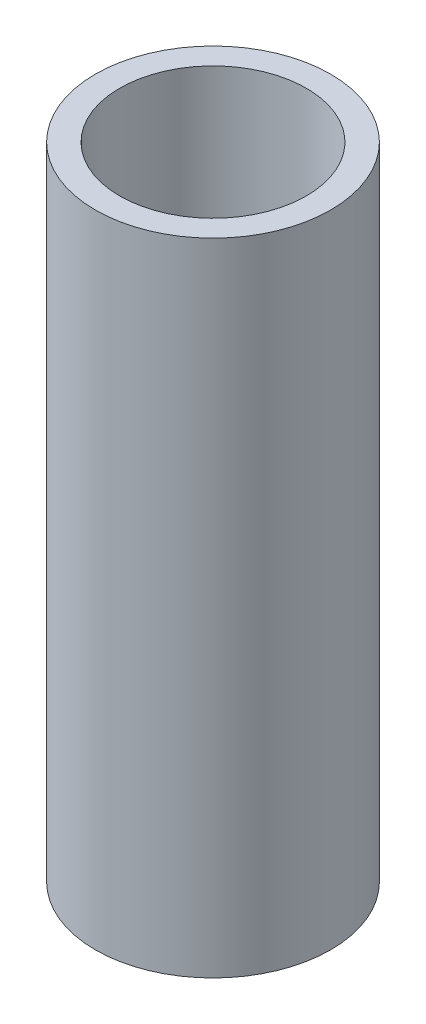
ISO-10303-21;
HEADER;
FILE_DESCRIPTION(('STEP AP214'),'2;1');
FILE_NAME('part.step','',(''),(''),'','','');
FILE_SCHEMA(('AUTOMOTIVE_DESIGN { 1 0 10303 214 1 1 1 1 }'));
ENDSEC;
DATA;
#1=APPLICATION_CONTEXT('core data for automotive mechanical design processes');
#2=APPLICATION_PROTOCOL_DEFINITION('international standard','automotive_design',2000,#1);
#3=PRODUCT_CONTEXT('',#1,'mechanical');
#4=PRODUCT('Part','Part','',(#3));
#5=PRODUCT_RELATED_PRODUCT_CATEGORY('part','',(#4));
#6=PRODUCT_DEFINITION_FORMATION('','',#4);
#7=PRODUCT_DEFINITION_CONTEXT('part definition',#1,'design');
#8=PRODUCT_DEFINITION('design','',#6,#7);
#9=PRODUCT_DEFINITION_SHAPE('','',#8);
#10=(LENGTH_UNIT() NAMED_UNIT(*) SI_UNIT(.MILLI.,.METRE.));
#11=(NAMED_UNIT(*) PLANE_ANGLE_UNIT() SI_UNIT($,.RADIAN.));
#12=(NAMED_UNIT(*) SI_UNIT($,.STERADIAN.) SOLID_ANGLE_UNIT());
#13=UNCERTAINTY_MEASURE_WITH_UNIT(LENGTH_MEASURE(1.E-05),#10,'distance_accuracy_value','');
#14=(GEOMETRIC_REPRESENTATION_CONTEXT(3) GLOBAL_UNCERTAINTY_ASSIGNED_CONTEXT((#13)) GLOBAL_UNIT_ASSIGNED_CONTEXT((#10,
#11,#12)) REPRESENTATION_CONTEXT('',''));
#15=CARTESIAN_POINT('',(0.,0.,0.));
#16=DIRECTION('',(0.,0.,1.));
#17=DIRECTION('',(1.,0.,0.));
#18=AXIS2_PLACEMENT_3D('',#15,#16,#17);
#19=CARTESIAN_POINT('',(0.,149.741743271689,0.));
#20=DIRECTION('',(0.,-1.,0.));
#21=DIRECTION('',(0.,0.,-1.));
#22=AXIS2_PLACEMENT_3D('',#19,#20,#21);
#23=CYLINDRICAL_SURFACE('',#22,27.5);
#24=CARTESIAN_POINT('',(0.,149.741743271689,0.));
#25=DIRECTION('',(0.,1.,0.));
#26=DIRECTION('',(0.,0.,1.));
#27=AXIS2_PLACEMENT_3D('',#24,#25,#26);
#28=CIRCLE('',#27,27.5);
#29=CARTESIAN_POINT('',(0.,149.741743271689,27.5));
#30=VERTEX_POINT('',#29);
#31=EDGE_CURVE('E10',#30,#30,#28,.T.);
#32=ORIENTED_EDGE('',*,*,#31,.F.);
#33=EDGE_LOOP('',(#32));
#34=FACE_BOUND('',#33,.T.);
#35=CARTESIAN_POINT('',(0.,0.,0.));
#36=DIRECTION('',(0.,1.,0.));
#37=DIRECTION('',(0.,0.,1.));
#38=AXIS2_PLACEMENT_3D('',#35,#36,#37);
#39=CIRCLE('',#38,27.5);
#40=CARTESIAN_POINT('',(0.,0.,27.5));
#41=VERTEX_POINT('',#40);
#42=EDGE_CURVE('E37',#41,#41,#39,.T.);
#43=ORIENTED_EDGE('',*,*,#42,.T.);
#44=EDGE_LOOP('',(#43));
#45=FACE_BOUND('',#44,.T.);
#46=ADVANCED_FACE('F40',(#34,#45),#23,.T.);
#47=CARTESIAN_POINT('',(0.,149.741743271689,0.));
#48=DIRECTION('',(0.,1.,0.));
#49=DIRECTION('',(0.,0.,1.));
#50=AXIS2_PLACEMENT_3D('',#47,#48,#49);
#51=PLANE('',#50);
#52=CARTESIAN_POINT('',(0.,149.741743271689,0.));
#53=DIRECTION('',(0.,1.,0.));
#54=DIRECTION('',(0.,0.,1.));
#55=AXIS2_PLACEMENT_3D('',#52,#53,#54);
#56=CIRCLE('',#55,21.8128908296532);
#57=CARTESIAN_POINT('',(0.,149.741743271689,21.8128908296532));
#58=VERTEX_POINT('',#57);
#59=EDGE_CURVE('E50',#58,#58,#56,.T.);
#60=ORIENTED_EDGE('',*,*,#59,.F.);
#61=EDGE_LOOP('',(#60));
#62=FACE_BOUND('',#61,.T.);
#63=ORIENTED_EDGE('',*,*,#31,.T.);
#64=EDGE_LOOP('',(#63));
#65=FACE_BOUND('',#64,.T.);
#66=ADVANCED_FACE('F59',(#62,#65),#51,.T.);
#67=CARTESIAN_POINT('',(0.,0.,0.));
#68=DIRECTION('',(0.,1.,0.));
#69=DIRECTION('',(0.,0.,1.));
#70=AXIS2_PLACEMENT_3D('',#67,#68,#69);
#71=PLANE('',#70);
#72=CARTESIAN_POINT('',(0.,0.,0.));
#73=DIRECTION('',(0.,1.,0.));
#74=DIRECTION('',(0.,0.,1.));
#75=AXIS2_PLACEMENT_3D('',#72,#73,#74);
#76=CIRCLE('',#75,21.8128908296532);
#77=CARTESIAN_POINT('',(0.,0.,21.8128908296532));
#78=VERTEX_POINT('',#77);
#79=EDGE_CURVE('E47',#78,#78,#76,.T.);
#80=ORIENTED_EDGE('',*,*,#79,.T.);
#81=EDGE_LOOP('',(#80));
#82=FACE_BOUND('',#81,.T.);
#83=ORIENTED_EDGE('',*,*,#42,.F.);
#84=EDGE_LOOP('',(#83));
#85=FACE_BOUND('',#84,.T.);
#86=ADVANCED_FACE('F58',(#82,#85),#71,.F.);
#87=CARTESIAN_POINT('',(0.,149.741743271689,0.));
#88=DIRECTION('',(0.,-1.,0.));
#89=DIRECTION('',(0.,0.,-1.));
#90=AXIS2_PLACEMENT_3D('',#87,#88,#89);
#91=CYLINDRICAL_SURFACE('',#90,21.8128908296532);
#92=ORIENTED_EDGE('',*,*,#59,.T.);
#93=EDGE_LOOP('',(#92));
#94=FACE_BOUND('',#93,.T.);
#95=ORIENTED_EDGE('',*,*,#79,.F.);
#96=EDGE_LOOP('',(#95));
#97=FACE_BOUND('',#96,.T.);
#98=ADVANCED_FACE('F54',(#94,#97),#91,.F.);
#99=CLOSED_SHELL('',(#46,#66,#86,#98));
#100=MANIFOLD_SOLID_BREP('B2',#99);
#101=ADVANCED_BREP_SHAPE_REPRESENTATION('',(#18,#100),#14);
#102=SHAPE_DEFINITION_REPRESENTATION(#9,#101);
ENDSEC;
END-ISO-10303-21;
